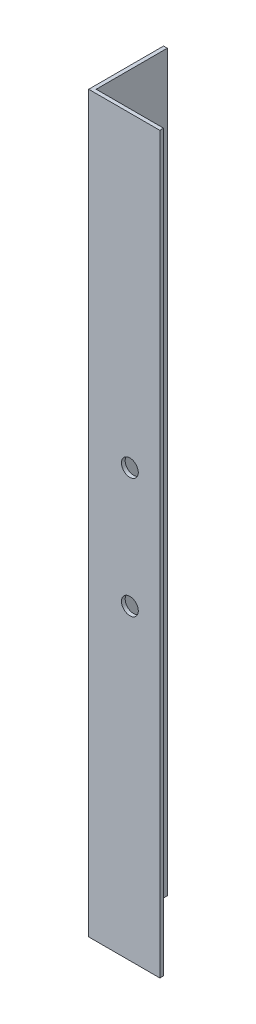
ISO-10303-21;
HEADER;
FILE_DESCRIPTION(('STEP AP214'),'2;1');
FILE_NAME('part.step','',(''),(''),'','','');
FILE_SCHEMA(('AUTOMOTIVE_DESIGN { 1 0 10303 214 1 1 1 1 }'));
ENDSEC;
DATA;
#1=APPLICATION_CONTEXT('core data for automotive mechanical design processes');
#2=APPLICATION_PROTOCOL_DEFINITION('international standard','automotive_design',2000,#1);
#3=PRODUCT_CONTEXT('',#1,'mechanical');
#4=PRODUCT('Part','Part','',(#3));
#5=PRODUCT_RELATED_PRODUCT_CATEGORY('part','',(#4));
#6=PRODUCT_DEFINITION_FORMATION('','',#4);
#7=PRODUCT_DEFINITION_CONTEXT('part definition',#1,'design');
#8=PRODUCT_DEFINITION('design','',#6,#7);
#9=PRODUCT_DEFINITION_SHAPE('','',#8);
#10=(LENGTH_UNIT() NAMED_UNIT(*) SI_UNIT(.MILLI.,.METRE.));
#11=(NAMED_UNIT(*) PLANE_ANGLE_UNIT() SI_UNIT($,.RADIAN.));
#12=(NAMED_UNIT(*) SI_UNIT($,.STERADIAN.) SOLID_ANGLE_UNIT());
#13=UNCERTAINTY_MEASURE_WITH_UNIT(LENGTH_MEASURE(1.E-05),#10,'distance_accuracy_value','');
#14=(GEOMETRIC_REPRESENTATION_CONTEXT(3) GLOBAL_UNCERTAINTY_ASSIGNED_CONTEXT((#13)) GLOBAL_UNIT_ASSIGNED_CONTEXT((#10,
#11,#12)) REPRESENTATION_CONTEXT('',''));
#15=CARTESIAN_POINT('',(0.,0.,0.));
#16=DIRECTION('',(0.,0.,1.));
#17=DIRECTION('',(1.,0.,0.));
#18=AXIS2_PLACEMENT_3D('',#15,#16,#17);
#19=CARTESIAN_POINT('',(20.,196.,0.));
#20=DIRECTION('',(0.,0.,-1.));
#21=DIRECTION('',(-1.,0.,0.));
#22=AXIS2_PLACEMENT_3D('',#19,#20,#21);
#23=PLANE('',#22);
#24=CARTESIAN_POINT('',(11.0000000000005,113.999999999998,0.));
#25=DIRECTION('',(0.,0.,-1.));
#26=DIRECTION('',(-1.,0.,0.));
#27=AXIS2_PLACEMENT_3D('',#24,#25,#26);
#28=CIRCLE('',#27,2.24999999999928);
#29=CARTESIAN_POINT('',(8.7500000000012,113.999999999998,0.));
#30=VERTEX_POINT('',#29);
#31=EDGE_CURVE('E148',#30,#30,#28,.T.);
#32=ORIENTED_EDGE('',*,*,#31,.T.);
#33=EDGE_LOOP('',(#32));
#34=FACE_BOUND('',#33,.T.);
#35=CARTESIAN_POINT('',(11.0000000000005,81.9999999999973,0.));
#36=DIRECTION('',(0.,0.,-1.));
#37=DIRECTION('',(-1.,0.,0.));
#38=AXIS2_PLACEMENT_3D('',#35,#36,#37);
#39=CIRCLE('',#38,2.25);
#40=CARTESIAN_POINT('',(8.75000000000047,81.9999999999973,0.));
#41=VERTEX_POINT('',#40);
#42=EDGE_CURVE('E144',#41,#41,#39,.T.);
#43=ORIENTED_EDGE('',*,*,#42,.T.);
#44=EDGE_LOOP('',(#43));
#45=FACE_BOUND('',#44,.T.);
#46=DIRECTION('',(0.,-1.,0.));
#47=VECTOR('',#46,1.);
#48=CARTESIAN_POINT('',(19.,196.,0.));
#49=LINE('',#48,#47);
#50=CARTESIAN_POINT('',(19.,196.,0.));
#51=VERTEX_POINT('',#50);
#52=CARTESIAN_POINT('',(19.,0.,0.));
#53=VERTEX_POINT('',#52);
#54=EDGE_CURVE('E48',#51,#53,#49,.T.);
#55=ORIENTED_EDGE('',*,*,#54,.F.);
#56=DIRECTION('',(1.,0.,0.));
#57=VECTOR('',#56,1.);
#58=CARTESIAN_POINT('',(20.,196.,0.));
#59=LINE('',#58,#57);
#60=CARTESIAN_POINT('',(0.,196.,0.));
#61=VERTEX_POINT('',#60);
#62=EDGE_CURVE('E120',#61,#51,#59,.T.);
#63=ORIENTED_EDGE('',*,*,#62,.F.);
#64=DIRECTION('',(0.,-1.,0.));
#65=VECTOR('',#64,1.);
#66=CARTESIAN_POINT('',(0.,196.,0.));
#67=LINE('',#66,#65);
#68=CARTESIAN_POINT('',(0.,0.,0.));
#69=VERTEX_POINT('',#68);
#70=EDGE_CURVE('E121',#61,#69,#67,.T.);
#71=ORIENTED_EDGE('',*,*,#70,.T.);
#72=DIRECTION('',(1.,0.,0.));
#73=VECTOR('',#72,1.);
#74=CARTESIAN_POINT('',(20.,0.,0.));
#75=LINE('',#74,#73);
#76=EDGE_CURVE('E111',#69,#53,#75,.T.);
#77=ORIENTED_EDGE('',*,*,#76,.T.);
#78=EDGE_LOOP('',(#55,#63,#71,#77));
#79=FACE_BOUND('',#78,.T.);
#80=ADVANCED_FACE('F34',(#34,#45,#79),#23,.F.);
#81=CARTESIAN_POINT('',(1.,196.,-0.999999999999997));
#82=DIRECTION('',(0.,0.,1.));
#83=DIRECTION('',(1.,0.,0.));
#84=AXIS2_PLACEMENT_3D('',#81,#82,#83);
#85=PLANE('',#84);
#86=CARTESIAN_POINT('',(11.0000000000005,113.999999999998,-0.999999999999998));
#87=DIRECTION('',(0.,0.,-1.));
#88=DIRECTION('',(-1.,0.,0.));
#89=AXIS2_PLACEMENT_3D('',#86,#87,#88);
#90=CIRCLE('',#89,2.24999999999928);
#91=CARTESIAN_POINT('',(8.7500000000012,113.999999999998,-0.999999999999998));
#92=VERTEX_POINT('',#91);
#93=EDGE_CURVE('E151',#92,#92,#90,.T.);
#94=ORIENTED_EDGE('',*,*,#93,.F.);
#95=EDGE_LOOP('',(#94));
#96=FACE_BOUND('',#95,.T.);
#97=CARTESIAN_POINT('',(11.0000000000005,81.9999999999973,-0.999999999999998));
#98=DIRECTION('',(0.,0.,-1.));
#99=DIRECTION('',(-1.,0.,0.));
#100=AXIS2_PLACEMENT_3D('',#97,#98,#99);
#101=CIRCLE('',#100,2.25);
#102=CARTESIAN_POINT('',(8.75000000000047,81.9999999999973,-0.999999999999998));
#103=VERTEX_POINT('',#102);
#104=EDGE_CURVE('E145',#103,#103,#101,.T.);
#105=ORIENTED_EDGE('',*,*,#104,.F.);
#106=EDGE_LOOP('',(#105));
#107=FACE_BOUND('',#106,.T.);
#108=DIRECTION('',(0.,1.,0.));
#109=VECTOR('',#108,1.);
#110=CARTESIAN_POINT('',(19.,0.,-0.999999999999998));
#111=LINE('',#110,#109);
#112=CARTESIAN_POINT('',(19.,0.,-0.999999999999998));
#113=VERTEX_POINT('',#112);
#114=CARTESIAN_POINT('',(19.,196.,-0.999999999999998));
#115=VERTEX_POINT('',#114);
#116=EDGE_CURVE('E96',#113,#115,#111,.T.);
#117=ORIENTED_EDGE('',*,*,#116,.F.);
#118=DIRECTION('',(-1.,0.,0.));
#119=VECTOR('',#118,1.);
#120=CARTESIAN_POINT('',(1.,0.,-0.999999999999997));
#121=LINE('',#120,#119);
#122=CARTESIAN_POINT('',(1.,0.,-0.999999999999997));
#123=VERTEX_POINT('',#122);
#124=EDGE_CURVE('E104',#113,#123,#121,.T.);
#125=ORIENTED_EDGE('',*,*,#124,.T.);
#126=DIRECTION('',(0.,-1.,0.));
#127=VECTOR('',#126,1.);
#128=CARTESIAN_POINT('',(1.,196.,-0.999999999999997));
#129=LINE('',#128,#127);
#130=CARTESIAN_POINT('',(1.,196.,-0.999999999999997));
#131=VERTEX_POINT('',#130);
#132=EDGE_CURVE('E11',#131,#123,#129,.T.);
#133=ORIENTED_EDGE('',*,*,#132,.F.);
#134=DIRECTION('',(-1.,0.,0.));
#135=VECTOR('',#134,1.);
#136=CARTESIAN_POINT('',(1.,196.,-0.999999999999997));
#137=LINE('',#136,#135);
#138=EDGE_CURVE('E85',#115,#131,#137,.T.);
#139=ORIENTED_EDGE('',*,*,#138,.F.);
#140=EDGE_LOOP('',(#117,#125,#133,#139));
#141=FACE_BOUND('',#140,.T.);
#142=ADVANCED_FACE('F103',(#96,#107,#141),#85,.F.);
#143=CARTESIAN_POINT('',(0.,196.,0.));
#144=DIRECTION('',(0.,-1.,0.));
#145=DIRECTION('',(0.,0.,-1.));
#146=AXIS2_PLACEMENT_3D('',#143,#144,#145);
#147=PLANE('',#146);
#148=DIRECTION('',(0.,0.,1.));
#149=VECTOR('',#148,1.);
#150=CARTESIAN_POINT('',(19.,196.,-0.999999999999998));
#151=LINE('',#150,#149);
#152=EDGE_CURVE('E105',#115,#51,#151,.T.);
#153=ORIENTED_EDGE('',*,*,#152,.F.);
#154=ORIENTED_EDGE('',*,*,#138,.T.);
#155=DIRECTION('',(0.,0.,-1.));
#156=VECTOR('',#155,1.);
#157=CARTESIAN_POINT('',(0.999999999999998,196.,-20.));
#158=LINE('',#157,#156);
#159=CARTESIAN_POINT('',(0.999999999999998,196.,-20.));
#160=VERTEX_POINT('',#159);
#161=EDGE_CURVE('E136',#131,#160,#158,.T.);
#162=ORIENTED_EDGE('',*,*,#161,.T.);
#163=DIRECTION('',(-1.,0.,0.));
#164=VECTOR('',#163,1.);
#165=CARTESIAN_POINT('',(0.,196.,-20.));
#166=LINE('',#165,#164);
#167=CARTESIAN_POINT('',(0.,196.,-20.));
#168=VERTEX_POINT('',#167);
#169=EDGE_CURVE('E130',#160,#168,#166,.T.);
#170=ORIENTED_EDGE('',*,*,#169,.T.);
#171=DIRECTION('',(0.,0.,1.));
#172=VECTOR('',#171,1.);
#173=CARTESIAN_POINT('',(0.,196.,0.));
#174=LINE('',#173,#172);
#175=EDGE_CURVE('E57',#168,#61,#174,.T.);
#176=ORIENTED_EDGE('',*,*,#175,.T.);
#177=ORIENTED_EDGE('',*,*,#62,.T.);
#178=EDGE_LOOP('',(#153,#154,#162,#170,#176,#177));
#179=FACE_BOUND('',#178,.T.);
#180=ADVANCED_FACE('F168',(#179),#147,.F.);
#181=CARTESIAN_POINT('',(0.,0.,0.));
#182=DIRECTION('',(0.,-1.,0.));
#183=DIRECTION('',(0.,0.,-1.));
#184=AXIS2_PLACEMENT_3D('',#181,#182,#183);
#185=PLANE('',#184);
#186=ORIENTED_EDGE('',*,*,#124,.F.);
#187=DIRECTION('',(0.,0.,-1.));
#188=VECTOR('',#187,1.);
#189=CARTESIAN_POINT('',(19.,0.,0.));
#190=LINE('',#189,#188);
#191=EDGE_CURVE('E93',#53,#113,#190,.T.);
#192=ORIENTED_EDGE('',*,*,#191,.F.);
#193=ORIENTED_EDGE('',*,*,#76,.F.);
#194=DIRECTION('',(0.,0.,1.));
#195=VECTOR('',#194,1.);
#196=CARTESIAN_POINT('',(0.,0.,0.));
#197=LINE('',#196,#195);
#198=CARTESIAN_POINT('',(0.,0.,-20.));
#199=VERTEX_POINT('',#198);
#200=EDGE_CURVE('E78',#199,#69,#197,.T.);
#201=ORIENTED_EDGE('',*,*,#200,.F.);
#202=DIRECTION('',(-1.,0.,0.));
#203=VECTOR('',#202,1.);
#204=CARTESIAN_POINT('',(0.,0.,-20.));
#205=LINE('',#204,#203);
#206=CARTESIAN_POINT('',(0.999999999999998,0.,-20.));
#207=VERTEX_POINT('',#206);
#208=EDGE_CURVE('E113',#207,#199,#205,.T.);
#209=ORIENTED_EDGE('',*,*,#208,.F.);
#210=DIRECTION('',(0.,0.,-1.));
#211=VECTOR('',#210,1.);
#212=CARTESIAN_POINT('',(0.999999999999998,0.,-20.));
#213=LINE('',#212,#211);
#214=EDGE_CURVE('E110',#123,#207,#213,.T.);
#215=ORIENTED_EDGE('',*,*,#214,.F.);
#216=EDGE_LOOP('',(#186,#192,#193,#201,#209,#215));
#217=FACE_BOUND('',#216,.T.);
#218=ADVANCED_FACE('F108',(#217),#185,.T.);
#219=CARTESIAN_POINT('',(0.999999999999998,196.,-20.));
#220=DIRECTION('',(-1.,0.,0.));
#221=DIRECTION('',(0.,0.,1.));
#222=AXIS2_PLACEMENT_3D('',#219,#220,#221);
#223=PLANE('',#222);
#224=ORIENTED_EDGE('',*,*,#214,.T.);
#225=DIRECTION('',(0.,-1.,0.));
#226=VECTOR('',#225,1.);
#227=CARTESIAN_POINT('',(0.999999999999998,196.,-20.));
#228=LINE('',#227,#226);
#229=EDGE_CURVE('E41',#160,#207,#228,.T.);
#230=ORIENTED_EDGE('',*,*,#229,.F.);
#231=ORIENTED_EDGE('',*,*,#161,.F.);
#232=ORIENTED_EDGE('',*,*,#132,.T.);
#233=EDGE_LOOP('',(#224,#230,#231,#232));
#234=FACE_BOUND('',#233,.T.);
#235=ADVANCED_FACE('F221',(#234),#223,.F.);
#236=CARTESIAN_POINT('',(0.,196.,-20.));
#237=DIRECTION('',(0.,0.,1.));
#238=DIRECTION('',(1.,0.,0.));
#239=AXIS2_PLACEMENT_3D('',#236,#237,#238);
#240=PLANE('',#239);
#241=ORIENTED_EDGE('',*,*,#208,.T.);
#242=DIRECTION('',(0.,-1.,0.));
#243=VECTOR('',#242,1.);
#244=CARTESIAN_POINT('',(0.,196.,-20.));
#245=LINE('',#244,#243);
#246=EDGE_CURVE('E123',#168,#199,#245,.T.);
#247=ORIENTED_EDGE('',*,*,#246,.F.);
#248=ORIENTED_EDGE('',*,*,#169,.F.);
#249=ORIENTED_EDGE('',*,*,#229,.T.);
#250=EDGE_LOOP('',(#241,#247,#248,#249));
#251=FACE_BOUND('',#250,.T.);
#252=ADVANCED_FACE('F128',(#251),#240,.F.);
#253=CARTESIAN_POINT('',(0.,196.,0.));
#254=DIRECTION('',(1.,0.,0.));
#255=DIRECTION('',(0.,0.,-1.));
#256=AXIS2_PLACEMENT_3D('',#253,#254,#255);
#257=PLANE('',#256);
#258=ORIENTED_EDGE('',*,*,#200,.T.);
#259=ORIENTED_EDGE('',*,*,#70,.F.);
#260=ORIENTED_EDGE('',*,*,#175,.F.);
#261=ORIENTED_EDGE('',*,*,#246,.T.);
#262=EDGE_LOOP('',(#258,#259,#260,#261));
#263=FACE_BOUND('',#262,.T.);
#264=ADVANCED_FACE('F135',(#263),#257,.F.);
#265=CARTESIAN_POINT('',(19.,0.,0.));
#266=DIRECTION('',(1.,0.,0.));
#267=DIRECTION('',(0.,0.,-1.));
#268=AXIS2_PLACEMENT_3D('',#265,#266,#267);
#269=PLANE('',#268);
#270=ORIENTED_EDGE('',*,*,#54,.T.);
#271=ORIENTED_EDGE('',*,*,#191,.T.);
#272=ORIENTED_EDGE('',*,*,#116,.T.);
#273=ORIENTED_EDGE('',*,*,#152,.T.);
#274=EDGE_LOOP('',(#270,#271,#272,#273));
#275=FACE_BOUND('',#274,.T.);
#276=ADVANCED_FACE('F95',(#275),#269,.T.);
#277=CARTESIAN_POINT('',(11.0000000000005,81.9999999999973,0.));
#278=DIRECTION('',(0.,0.,-1.));
#279=DIRECTION('',(-1.,0.,0.));
#280=AXIS2_PLACEMENT_3D('',#277,#278,#279);
#281=CYLINDRICAL_SURFACE('',#280,2.25);
#282=ORIENTED_EDGE('',*,*,#42,.F.);
#283=EDGE_LOOP('',(#282));
#284=FACE_BOUND('',#283,.T.);
#285=ORIENTED_EDGE('',*,*,#104,.T.);
#286=EDGE_LOOP('',(#285));
#287=FACE_BOUND('',#286,.T.);
#288=ADVANCED_FACE('F162',(#284,#287),#281,.F.);
#289=CARTESIAN_POINT('',(11.0000000000005,113.999999999998,0.));
#290=DIRECTION('',(0.,0.,-1.));
#291=DIRECTION('',(-1.,0.,0.));
#292=AXIS2_PLACEMENT_3D('',#289,#290,#291);
#293=CYLINDRICAL_SURFACE('',#292,2.24999999999928);
#294=ORIENTED_EDGE('',*,*,#31,.F.);
#295=EDGE_LOOP('',(#294));
#296=FACE_BOUND('',#295,.T.);
#297=ORIENTED_EDGE('',*,*,#93,.T.);
#298=EDGE_LOOP('',(#297));
#299=FACE_BOUND('',#298,.T.);
#300=ADVANCED_FACE('F159',(#296,#299),#293,.F.);
#301=CLOSED_SHELL('',(#80,#142,#180,#218,#235,#252,#264,#276,#288,#300));
#302=MANIFOLD_SOLID_BREP('B2',#301);
#303=ADVANCED_BREP_SHAPE_REPRESENTATION('',(#18,#302),#14);
#304=SHAPE_DEFINITION_REPRESENTATION(#9,#303);
ENDSEC;
END-ISO-10303-21;
